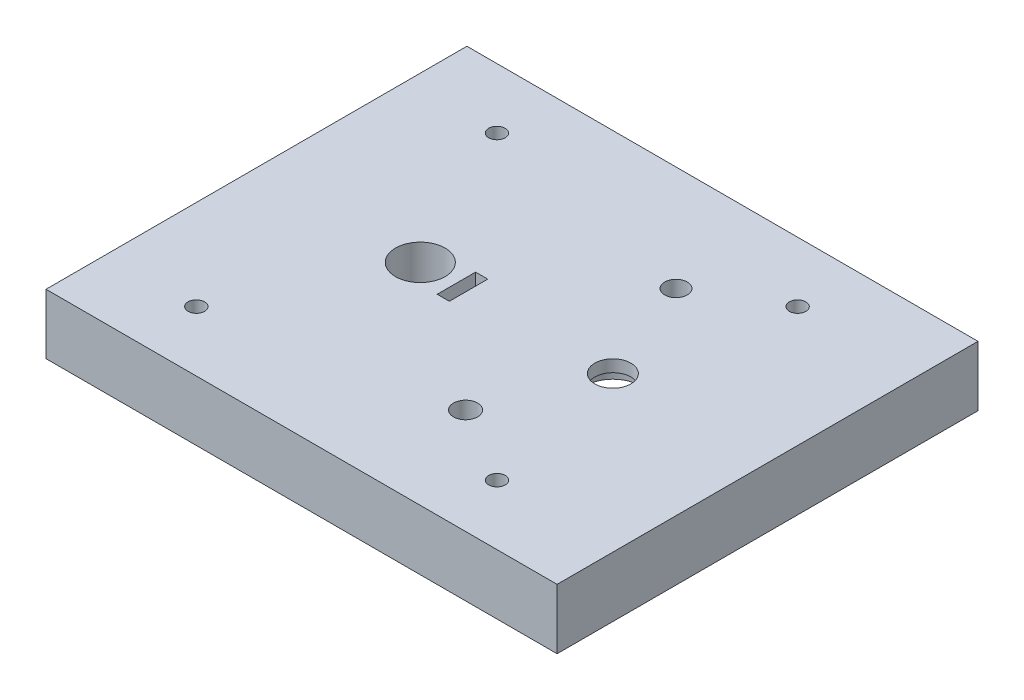
ISO-10303-21;
HEADER;
FILE_DESCRIPTION(('STEP AP214'),'2;1');
FILE_NAME('part.step','',(''),(''),'','','');
FILE_SCHEMA(('AUTOMOTIVE_DESIGN { 1 0 10303 214 1 1 1 1 }'));
ENDSEC;
DATA;
#1=APPLICATION_CONTEXT('core data for automotive mechanical design processes');
#2=APPLICATION_PROTOCOL_DEFINITION('international standard','automotive_design',2000,#1);
#3=PRODUCT_CONTEXT('',#1,'mechanical');
#4=PRODUCT('Part','Part','',(#3));
#5=PRODUCT_RELATED_PRODUCT_CATEGORY('part','',(#4));
#6=PRODUCT_DEFINITION_FORMATION('','',#4);
#7=PRODUCT_DEFINITION_CONTEXT('part definition',#1,'design');
#8=PRODUCT_DEFINITION('design','',#6,#7);
#9=PRODUCT_DEFINITION_SHAPE('','',#8);
#10=(LENGTH_UNIT() NAMED_UNIT(*) SI_UNIT(.MILLI.,.METRE.));
#11=(NAMED_UNIT(*) PLANE_ANGLE_UNIT() SI_UNIT($,.RADIAN.));
#12=(NAMED_UNIT(*) SI_UNIT($,.STERADIAN.) SOLID_ANGLE_UNIT());
#13=UNCERTAINTY_MEASURE_WITH_UNIT(LENGTH_MEASURE(1.E-05),#10,'distance_accuracy_value','');
#14=(GEOMETRIC_REPRESENTATION_CONTEXT(3) GLOBAL_UNCERTAINTY_ASSIGNED_CONTEXT((#13)) GLOBAL_UNIT_ASSIGNED_CONTEXT((#10,
#11,#12)) REPRESENTATION_CONTEXT('',''));
#15=CARTESIAN_POINT('',(0.,0.,0.));
#16=DIRECTION('',(0.,0.,1.));
#17=DIRECTION('',(1.,0.,0.));
#18=AXIS2_PLACEMENT_3D('',#15,#16,#17);
#19=CARTESIAN_POINT('',(0.,0.,0.));
#20=DIRECTION('',(0.,1.,0.));
#21=DIRECTION('',(0.,0.,1.));
#22=AXIS2_PLACEMENT_3D('',#19,#20,#21);
#23=PLANE('',#22);
#24=CARTESIAN_POINT('',(-37.2759249064414,0.,25.));
#25=DIRECTION('',(0.,1.,0.));
#26=DIRECTION('',(0.,0.,1.));
#27=AXIS2_PLACEMENT_3D('',#24,#25,#26);
#28=CIRCLE('',#27,1.375);
#29=CARTESIAN_POINT('',(-37.2759249064414,0.,26.375));
#30=VERTEX_POINT('',#29);
#31=EDGE_CURVE('E205',#30,#30,#28,.F.);
#32=ORIENTED_EDGE('',*,*,#31,.F.);
#33=EDGE_LOOP('',(#32));
#34=FACE_BOUND('',#33,.T.);
#35=DIRECTION('',(0.,0.,1.));
#36=VECTOR('',#35,1.);
#37=CARTESIAN_POINT('',(32.7240750935587,0.,0.));
#38=LINE('',#37,#36);
#39=CARTESIAN_POINT('',(32.7240750935586,0.,-35.));
#40=VERTEX_POINT('',#39);
#41=CARTESIAN_POINT('',(32.7240750935587,0.,35.));
#42=VERTEX_POINT('',#41);
#43=EDGE_CURVE('E195',#40,#42,#38,.T.);
#44=ORIENTED_EDGE('',*,*,#43,.T.);
#45=DIRECTION('',(1.,0.,0.));
#46=VECTOR('',#45,1.);
#47=CARTESIAN_POINT('',(0.,0.,35.));
#48=LINE('',#47,#46);
#49=CARTESIAN_POINT('',(-52.2759249064413,0.,35.));
#50=VERTEX_POINT('',#49);
#51=EDGE_CURVE('E87',#50,#42,#48,.T.);
#52=ORIENTED_EDGE('',*,*,#51,.F.);
#53=DIRECTION('',(0.,0.,1.));
#54=VECTOR('',#53,1.);
#55=CARTESIAN_POINT('',(-52.2759249064413,0.,0.));
#56=LINE('',#55,#54);
#57=CARTESIAN_POINT('',(-52.2759249064414,0.,-35.));
#58=VERTEX_POINT('',#57);
#59=EDGE_CURVE('E200',#58,#50,#56,.T.);
#60=ORIENTED_EDGE('',*,*,#59,.F.);
#61=DIRECTION('',(1.,0.,0.));
#62=VECTOR('',#61,1.);
#63=CARTESIAN_POINT('',(0.,0.,-35.));
#64=LINE('',#63,#62);
#65=EDGE_CURVE('E126',#58,#40,#64,.T.);
#66=ORIENTED_EDGE('',*,*,#65,.T.);
#67=EDGE_LOOP('',(#44,#52,#60,#66));
#68=FACE_BOUND('',#67,.T.);
#69=CARTESIAN_POINT('',(-37.2759249064414,0.,-25.));
#70=DIRECTION('',(0.,1.,0.));
#71=DIRECTION('',(0.,0.,1.));
#72=AXIS2_PLACEMENT_3D('',#69,#70,#71);
#73=CIRCLE('',#72,1.375);
#74=CARTESIAN_POINT('',(-37.2759249064414,0.,-23.625));
#75=VERTEX_POINT('',#74);
#76=EDGE_CURVE('E191',#75,#75,#73,.T.);
#77=ORIENTED_EDGE('',*,*,#76,.T.);
#78=EDGE_LOOP('',(#77));
#79=FACE_BOUND('',#78,.T.);
#80=CARTESIAN_POINT('',(12.7240750935586,0.,-25.));
#81=DIRECTION('',(0.,1.,0.));
#82=DIRECTION('',(0.,0.,1.));
#83=AXIS2_PLACEMENT_3D('',#80,#81,#82);
#84=CIRCLE('',#83,1.375);
#85=CARTESIAN_POINT('',(12.7240750935586,0.,-23.625));
#86=VERTEX_POINT('',#85);
#87=EDGE_CURVE('E187',#86,#86,#84,.T.);
#88=ORIENTED_EDGE('',*,*,#87,.T.);
#89=EDGE_LOOP('',(#88));
#90=FACE_BOUND('',#89,.T.);
#91=CARTESIAN_POINT('',(12.7240750935586,0.,25.));
#92=DIRECTION('',(0.,1.,0.));
#93=DIRECTION('',(0.,0.,1.));
#94=AXIS2_PLACEMENT_3D('',#91,#92,#93);
#95=CIRCLE('',#94,1.375);
#96=CARTESIAN_POINT('',(12.7240750935586,0.,26.375));
#97=VERTEX_POINT('',#96);
#98=EDGE_CURVE('E183',#97,#97,#95,.F.);
#99=ORIENTED_EDGE('',*,*,#98,.F.);
#100=EDGE_LOOP('',(#99));
#101=FACE_BOUND('',#100,.T.);
#102=CARTESIAN_POINT('',(-25.0246823688517,0.,0.));
#103=DIRECTION('',(0.,1.,0.));
#104=DIRECTION('',(0.,0.,1.));
#105=AXIS2_PLACEMENT_3D('',#102,#103,#104);
#106=CIRCLE('',#105,4.12500000000001);
#107=CARTESIAN_POINT('',(-25.0246823688517,0.,4.12500000000001));
#108=VERTEX_POINT('',#107);
#109=EDGE_CURVE('E179',#108,#108,#106,.T.);
#110=ORIENTED_EDGE('',*,*,#109,.T.);
#111=EDGE_LOOP('',(#110));
#112=FACE_BOUND('',#111,.T.);
#113=DIRECTION('',(1.,0.,0.));
#114=VECTOR('',#113,1.);
#115=CARTESIAN_POINT('',(0.,0.,3.19298794369084));
#116=LINE('',#115,#114);
#117=CARTESIAN_POINT('',(-19.0246823688517,0.,3.19298794369084));
#118=VERTEX_POINT('',#117);
#119=CARTESIAN_POINT('',(-17.,0.,3.19298794369084));
#120=VERTEX_POINT('',#119);
#121=EDGE_CURVE('E166',#118,#120,#116,.T.);
#122=ORIENTED_EDGE('',*,*,#121,.T.);
#123=DIRECTION('',(0.,0.,-1.));
#124=VECTOR('',#123,1.);
#125=CARTESIAN_POINT('',(-17.,0.,0.));
#126=LINE('',#125,#124);
#127=CARTESIAN_POINT('',(-17.,0.,7.));
#128=VERTEX_POINT('',#127);
#129=EDGE_CURVE('E510',#128,#120,#126,.T.);
#130=ORIENTED_EDGE('',*,*,#129,.F.);
#131=DIRECTION('',(1.,0.,0.));
#132=VECTOR('',#131,1.);
#133=CARTESIAN_POINT('',(0.,0.,7.));
#134=LINE('',#133,#132);
#135=CARTESIAN_POINT('',(-12.3547561691844,0.,7.));
#136=VERTEX_POINT('',#135);
#137=EDGE_CURVE('E516',#128,#136,#134,.T.);
#138=ORIENTED_EDGE('',*,*,#137,.T.);
#139=CARTESIAN_POINT('',(0.,0.,0.));
#140=DIRECTION('',(0.,1.,0.));
#141=DIRECTION('',(0.,0.,1.));
#142=AXIS2_PLACEMENT_3D('',#139,#140,#141);
#143=CIRCLE('',#142,14.2);
#144=CARTESIAN_POINT('',(-3.625,0.,13.7295074565696));
#145=VERTEX_POINT('',#144);
#146=EDGE_CURVE('E522',#136,#145,#143,.T.);
#147=ORIENTED_EDGE('',*,*,#146,.T.);
#148=DIRECTION('',(0.,0.,-1.));
#149=VECTOR('',#148,1.);
#150=CARTESIAN_POINT('',(-3.62500000000001,0.,0.));
#151=LINE('',#150,#149);
#152=CARTESIAN_POINT('',(-3.625,0.,17.5));
#153=VERTEX_POINT('',#152);
#154=EDGE_CURVE('E636',#153,#145,#151,.T.);
#155=ORIENTED_EDGE('',*,*,#154,.F.);
#156=CARTESIAN_POINT('',(0.,0.,17.5));
#157=DIRECTION('',(0.,1.,0.));
#158=DIRECTION('',(0.,0.,1.));
#159=AXIS2_PLACEMENT_3D('',#156,#157,#158);
#160=CIRCLE('',#159,3.625);
#161=CARTESIAN_POINT('',(3.625,0.,17.5));
#162=VERTEX_POINT('',#161);
#163=EDGE_CURVE('E640',#153,#162,#160,.T.);
#164=ORIENTED_EDGE('',*,*,#163,.T.);
#165=DIRECTION('',(0.,0.,-1.));
#166=VECTOR('',#165,1.);
#167=CARTESIAN_POINT('',(3.625,0.,0.));
#168=LINE('',#167,#166);
#169=CARTESIAN_POINT('',(3.625,0.,13.7295074565696));
#170=VERTEX_POINT('',#169);
#171=EDGE_CURVE('E645',#162,#170,#168,.T.);
#172=ORIENTED_EDGE('',*,*,#171,.T.);
#173=CARTESIAN_POINT('',(0.,0.,0.));
#174=DIRECTION('',(0.,1.,0.));
#175=DIRECTION('',(0.,0.,1.));
#176=AXIS2_PLACEMENT_3D('',#173,#174,#175);
#177=CIRCLE('',#176,14.2);
#178=CARTESIAN_POINT('',(3.62500000000001,0.,-13.7295074565696));
#179=VERTEX_POINT('',#178);
#180=EDGE_CURVE('E649',#170,#179,#177,.T.);
#181=ORIENTED_EDGE('',*,*,#180,.T.);
#182=DIRECTION('',(0.,0.,1.));
#183=VECTOR('',#182,1.);
#184=CARTESIAN_POINT('',(3.62500000000006,0.,0.));
#185=LINE('',#184,#183);
#186=CARTESIAN_POINT('',(3.62499999999999,0.,-17.5));
#187=VERTEX_POINT('',#186);
#188=EDGE_CURVE('E653',#187,#179,#185,.T.);
#189=ORIENTED_EDGE('',*,*,#188,.F.);
#190=CARTESIAN_POINT('',(0.,0.,-17.5));
#191=DIRECTION('',(0.,1.,0.));
#192=DIRECTION('',(0.,0.,1.));
#193=AXIS2_PLACEMENT_3D('',#190,#191,#192);
#194=CIRCLE('',#193,3.62499999999999);
#195=CARTESIAN_POINT('',(-3.625,0.,-17.5));
#196=VERTEX_POINT('',#195);
#197=EDGE_CURVE('E347',#187,#196,#194,.T.);
#198=ORIENTED_EDGE('',*,*,#197,.T.);
#199=DIRECTION('',(0.,0.,1.));
#200=VECTOR('',#199,1.);
#201=CARTESIAN_POINT('',(-3.62499999999998,0.,0.));
#202=LINE('',#201,#200);
#203=CARTESIAN_POINT('',(-3.62499999999999,0.,-13.7295074565696));
#204=VERTEX_POINT('',#203);
#205=EDGE_CURVE('E343',#196,#204,#202,.T.);
#206=ORIENTED_EDGE('',*,*,#205,.T.);
#207=CARTESIAN_POINT('',(0.,0.,0.));
#208=DIRECTION('',(0.,1.,0.));
#209=DIRECTION('',(0.,0.,1.));
#210=AXIS2_PLACEMENT_3D('',#207,#208,#209);
#211=CIRCLE('',#210,14.2);
#212=CARTESIAN_POINT('',(-12.3547561691844,0.,-7.));
#213=VERTEX_POINT('',#212);
#214=EDGE_CURVE('E321',#204,#213,#211,.T.);
#215=ORIENTED_EDGE('',*,*,#214,.T.);
#216=DIRECTION('',(1.,0.,0.));
#217=VECTOR('',#216,1.);
#218=CARTESIAN_POINT('',(0.,0.,-7.));
#219=LINE('',#218,#217);
#220=CARTESIAN_POINT('',(-17.,0.,-7.));
#221=VERTEX_POINT('',#220);
#222=EDGE_CURVE('E333',#221,#213,#219,.T.);
#223=ORIENTED_EDGE('',*,*,#222,.F.);
#224=CARTESIAN_POINT('',(-17.,0.,-3.19298794369084));
#225=VERTEX_POINT('',#224);
#226=EDGE_CURVE('E339',#225,#221,#126,.T.);
#227=ORIENTED_EDGE('',*,*,#226,.F.);
#228=DIRECTION('',(1.,0.,0.));
#229=VECTOR('',#228,1.);
#230=CARTESIAN_POINT('',(0.,0.,-3.19298794369084));
#231=LINE('',#230,#229);
#232=CARTESIAN_POINT('',(-19.0246823688517,0.,-3.19298794369084));
#233=VERTEX_POINT('',#232);
#234=EDGE_CURVE('E175',#233,#225,#231,.T.);
#235=ORIENTED_EDGE('',*,*,#234,.F.);
#236=DIRECTION('',(0.,0.,-1.));
#237=VECTOR('',#236,1.);
#238=CARTESIAN_POINT('',(-19.0246823688517,0.,0.));
#239=LINE('',#238,#237);
#240=EDGE_CURVE('E170',#118,#233,#239,.T.);
#241=ORIENTED_EDGE('',*,*,#240,.F.);
#242=EDGE_LOOP('',(#122,#130,#138,#147,#155,#164,#172,#181,#189,#198,#206,#215,#223,#227,#235,#241));
#243=FACE_BOUND('',#242,.T.);
#244=ADVANCED_FACE('F41',(#34,#68,#79,#90,#101,#112,#243),#23,.F.);
#245=CARTESIAN_POINT('',(32.7240750935587,10.,0.));
#246=DIRECTION('',(1.,0.,0.));
#247=DIRECTION('',(0.,0.,-1.));
#248=AXIS2_PLACEMENT_3D('',#245,#246,#247);
#249=PLANE('',#248);
#250=ORIENTED_EDGE('',*,*,#43,.F.);
#251=DIRECTION('',(0.,-1.,0.));
#252=VECTOR('',#251,1.);
#253=CARTESIAN_POINT('',(32.7240750935586,10.,-35.));
#254=LINE('',#253,#252);
#255=CARTESIAN_POINT('',(32.7240750935586,10.,-35.));
#256=VERTEX_POINT('',#255);
#257=EDGE_CURVE('E11',#256,#40,#254,.T.);
#258=ORIENTED_EDGE('',*,*,#257,.F.);
#259=DIRECTION('',(0.,0.,1.));
#260=VECTOR('',#259,1.);
#261=CARTESIAN_POINT('',(32.7240750935587,10.,0.));
#262=LINE('',#261,#260);
#263=CARTESIAN_POINT('',(32.7240750935587,10.,35.));
#264=VERTEX_POINT('',#263);
#265=EDGE_CURVE('E139',#256,#264,#262,.T.);
#266=ORIENTED_EDGE('',*,*,#265,.T.);
#267=DIRECTION('',(0.,-1.,0.));
#268=VECTOR('',#267,1.);
#269=CARTESIAN_POINT('',(32.7240750935587,10.,35.));
#270=LINE('',#269,#268);
#271=EDGE_CURVE('E94',#264,#42,#270,.T.);
#272=ORIENTED_EDGE('',*,*,#271,.T.);
#273=EDGE_LOOP('',(#250,#258,#266,#272));
#274=FACE_BOUND('',#273,.T.);
#275=ADVANCED_FACE('F437',(#274),#249,.T.);
#276=CARTESIAN_POINT('',(0.,10.,-35.));
#277=DIRECTION('',(0.,0.,-1.));
#278=DIRECTION('',(-1.,0.,0.));
#279=AXIS2_PLACEMENT_3D('',#276,#277,#278);
#280=PLANE('',#279);
#281=ORIENTED_EDGE('',*,*,#65,.F.);
#282=DIRECTION('',(0.,-1.,0.));
#283=VECTOR('',#282,1.);
#284=CARTESIAN_POINT('',(-52.2759249064414,10.,-35.));
#285=LINE('',#284,#283);
#286=CARTESIAN_POINT('',(-52.2759249064414,10.,-35.));
#287=VERTEX_POINT('',#286);
#288=EDGE_CURVE('E52',#287,#58,#285,.T.);
#289=ORIENTED_EDGE('',*,*,#288,.F.);
#290=DIRECTION('',(1.,0.,0.));
#291=VECTOR('',#290,1.);
#292=CARTESIAN_POINT('',(0.,10.,-35.));
#293=LINE('',#292,#291);
#294=EDGE_CURVE('E124',#287,#256,#293,.T.);
#295=ORIENTED_EDGE('',*,*,#294,.T.);
#296=ORIENTED_EDGE('',*,*,#257,.T.);
#297=EDGE_LOOP('',(#281,#289,#295,#296));
#298=FACE_BOUND('',#297,.T.);
#299=ADVANCED_FACE('F122',(#298),#280,.T.);
#300=CARTESIAN_POINT('',(-52.2759249064413,10.,0.));
#301=DIRECTION('',(1.,0.,0.));
#302=DIRECTION('',(0.,0.,-1.));
#303=AXIS2_PLACEMENT_3D('',#300,#301,#302);
#304=PLANE('',#303);
#305=ORIENTED_EDGE('',*,*,#59,.T.);
#306=DIRECTION('',(0.,-1.,0.));
#307=VECTOR('',#306,1.);
#308=CARTESIAN_POINT('',(-52.2759249064413,10.,35.));
#309=LINE('',#308,#307);
#310=CARTESIAN_POINT('',(-52.2759249064413,10.,35.));
#311=VERTEX_POINT('',#310);
#312=EDGE_CURVE('E130',#311,#50,#309,.T.);
#313=ORIENTED_EDGE('',*,*,#312,.F.);
#314=DIRECTION('',(0.,0.,1.));
#315=VECTOR('',#314,1.);
#316=CARTESIAN_POINT('',(-52.2759249064413,10.,0.));
#317=LINE('',#316,#315);
#318=EDGE_CURVE('E133',#287,#311,#317,.T.);
#319=ORIENTED_EDGE('',*,*,#318,.F.);
#320=ORIENTED_EDGE('',*,*,#288,.T.);
#321=EDGE_LOOP('',(#305,#313,#319,#320));
#322=FACE_BOUND('',#321,.T.);
#323=ADVANCED_FACE('F134',(#322),#304,.F.);
#324=CARTESIAN_POINT('',(-17.,10.,0.));
#325=DIRECTION('',(-1.,0.,0.));
#326=DIRECTION('',(0.,0.,1.));
#327=AXIS2_PLACEMENT_3D('',#324,#325,#326);
#328=PLANE('',#327);
#329=DIRECTION('',(0.,0.,-1.));
#330=VECTOR('',#329,1.);
#331=CARTESIAN_POINT('',(-17.,6.,0.));
#332=LINE('',#331,#330);
#333=CARTESIAN_POINT('',(-17.,6.,3.19298794369084));
#334=VERTEX_POINT('',#333);
#335=CARTESIAN_POINT('',(-17.,6.,-3.19298794369084));
#336=VERTEX_POINT('',#335);
#337=EDGE_CURVE('E171',#334,#336,#332,.T.);
#338=ORIENTED_EDGE('',*,*,#337,.F.);
#339=DIRECTION('',(0.,-1.,0.));
#340=VECTOR('',#339,1.);
#341=CARTESIAN_POINT('',(-17.,10.,3.19298794369084));
#342=LINE('',#341,#340);
#343=CARTESIAN_POINT('',(-17.,10.,3.19298794369084));
#344=VERTEX_POINT('',#343);
#345=EDGE_CURVE('E45',#344,#334,#342,.T.);
#346=ORIENTED_EDGE('',*,*,#345,.F.);
#347=DIRECTION('',(0.,0.,-1.));
#348=VECTOR('',#347,1.);
#349=CARTESIAN_POINT('',(-17.,10.,0.));
#350=LINE('',#349,#348);
#351=CARTESIAN_POINT('',(-17.,10.,-3.19298794369084));
#352=VERTEX_POINT('',#351);
#353=EDGE_CURVE('E209',#344,#352,#350,.T.);
#354=ORIENTED_EDGE('',*,*,#353,.T.);
#355=DIRECTION('',(0.,-1.,0.));
#356=VECTOR('',#355,1.);
#357=CARTESIAN_POINT('',(-17.,10.,-3.19298794369084));
#358=LINE('',#357,#356);
#359=EDGE_CURVE('E165',#352,#336,#358,.T.);
#360=ORIENTED_EDGE('',*,*,#359,.T.);
#361=EDGE_LOOP('',(#338,#346,#354,#360));
#362=FACE_BOUND('',#361,.T.);
#363=ADVANCED_FACE('F43',(#362),#328,.T.);
#364=CARTESIAN_POINT('',(0.,10.,3.19298794369084));
#365=DIRECTION('',(0.,0.,-1.));
#366=DIRECTION('',(-1.,0.,0.));
#367=AXIS2_PLACEMENT_3D('',#364,#365,#366);
#368=PLANE('',#367);
#369=ORIENTED_EDGE('',*,*,#345,.T.);
#370=DIRECTION('',(0.,-1.,0.));
#371=VECTOR('',#370,1.);
#372=CARTESIAN_POINT('',(-17.,6.,3.19298794369084));
#373=LINE('',#372,#371);
#374=EDGE_CURVE('E233',#334,#120,#373,.T.);
#375=ORIENTED_EDGE('',*,*,#374,.T.);
#376=ORIENTED_EDGE('',*,*,#121,.F.);
#377=DIRECTION('',(0.,-1.,0.));
#378=VECTOR('',#377,1.);
#379=CARTESIAN_POINT('',(-19.0246823688517,10.,3.19298794369084));
#380=LINE('',#379,#378);
#381=CARTESIAN_POINT('',(-19.0246823688517,10.,3.19298794369084));
#382=VERTEX_POINT('',#381);
#383=EDGE_CURVE('E219',#382,#118,#380,.T.);
#384=ORIENTED_EDGE('',*,*,#383,.F.);
#385=DIRECTION('',(1.,0.,0.));
#386=VECTOR('',#385,1.);
#387=CARTESIAN_POINT('',(0.,10.,3.19298794369084));
#388=LINE('',#387,#386);
#389=EDGE_CURVE('E235',#382,#344,#388,.T.);
#390=ORIENTED_EDGE('',*,*,#389,.T.);
#391=EDGE_LOOP('',(#369,#375,#376,#384,#390));
#392=FACE_BOUND('',#391,.T.);
#393=ADVANCED_FACE('F229',(#392),#368,.T.);
#394=CARTESIAN_POINT('',(-19.0246823688517,10.,0.));
#395=DIRECTION('',(-1.,0.,0.));
#396=DIRECTION('',(0.,0.,1.));
#397=AXIS2_PLACEMENT_3D('',#394,#395,#396);
#398=PLANE('',#397);
#399=ORIENTED_EDGE('',*,*,#383,.T.);
#400=ORIENTED_EDGE('',*,*,#240,.T.);
#401=DIRECTION('',(0.,-1.,0.));
#402=VECTOR('',#401,1.);
#403=CARTESIAN_POINT('',(-19.0246823688517,10.,-3.19298794369084));
#404=LINE('',#403,#402);
#405=CARTESIAN_POINT('',(-19.0246823688517,10.,-3.19298794369084));
#406=VERTEX_POINT('',#405);
#407=EDGE_CURVE('E217',#406,#233,#404,.T.);
#408=ORIENTED_EDGE('',*,*,#407,.F.);
#409=DIRECTION('',(0.,0.,-1.));
#410=VECTOR('',#409,1.);
#411=CARTESIAN_POINT('',(-19.0246823688517,10.,0.));
#412=LINE('',#411,#410);
#413=EDGE_CURVE('E394',#382,#406,#412,.T.);
#414=ORIENTED_EDGE('',*,*,#413,.F.);
#415=EDGE_LOOP('',(#399,#400,#408,#414));
#416=FACE_BOUND('',#415,.T.);
#417=ADVANCED_FACE('F449',(#416),#398,.F.);
#418=CARTESIAN_POINT('',(0.,10.,17.5));
#419=DIRECTION('',(0.,-1.,0.));
#420=DIRECTION('',(0.,0.,-1.));
#421=AXIS2_PLACEMENT_3D('',#418,#419,#420);
#422=CYLINDRICAL_SURFACE('',#421,2.);
#423=CARTESIAN_POINT('',(0.,6.,17.5));
#424=DIRECTION('',(0.,1.,0.));
#425=DIRECTION('',(0.,0.,1.));
#426=AXIS2_PLACEMENT_3D('',#423,#424,#425);
#427=CIRCLE('',#426,2.);
#428=CARTESIAN_POINT('',(0.,6.,19.5));
#429=VERTEX_POINT('',#428);
#430=EDGE_CURVE('E354',#429,#429,#427,.T.);
#431=ORIENTED_EDGE('',*,*,#430,.F.);
#432=EDGE_LOOP('',(#431));
#433=FACE_BOUND('',#432,.T.);
#434=CARTESIAN_POINT('',(0.,10.,17.5));
#435=DIRECTION('',(0.,1.,0.));
#436=DIRECTION('',(0.,0.,1.));
#437=AXIS2_PLACEMENT_3D('',#434,#435,#436);
#438=CIRCLE('',#437,2.);
#439=CARTESIAN_POINT('',(0.,10.,19.5));
#440=VERTEX_POINT('',#439);
#441=EDGE_CURVE('E157',#440,#440,#438,.T.);
#442=ORIENTED_EDGE('',*,*,#441,.T.);
#443=EDGE_LOOP('',(#442));
#444=FACE_BOUND('',#443,.T.);
#445=ADVANCED_FACE('F445',(#433,#444),#422,.F.);
#446=CARTESIAN_POINT('',(0.,10.,-17.5));
#447=DIRECTION('',(0.,-1.,0.));
#448=DIRECTION('',(0.,0.,-1.));
#449=AXIS2_PLACEMENT_3D('',#446,#447,#448);
#450=CYLINDRICAL_SURFACE('',#449,1.875);
#451=CARTESIAN_POINT('',(0.,6.,-17.5));
#452=DIRECTION('',(0.,1.,0.));
#453=DIRECTION('',(0.,0.,1.));
#454=AXIS2_PLACEMENT_3D('',#451,#452,#453);
#455=CIRCLE('',#454,1.875);
#456=CARTESIAN_POINT('',(0.,6.,-15.625));
#457=VERTEX_POINT('',#456);
#458=EDGE_CURVE('E502',#457,#457,#455,.T.);
#459=ORIENTED_EDGE('',*,*,#458,.F.);
#460=EDGE_LOOP('',(#459));
#461=FACE_BOUND('',#460,.T.);
#462=CARTESIAN_POINT('',(0.,10.,-17.5));
#463=DIRECTION('',(0.,1.,0.));
#464=DIRECTION('',(0.,0.,1.));
#465=AXIS2_PLACEMENT_3D('',#462,#463,#464);
#466=CIRCLE('',#465,1.875);
#467=CARTESIAN_POINT('',(0.,10.,-15.625));
#468=VERTEX_POINT('',#467);
#469=EDGE_CURVE('E153',#468,#468,#466,.T.);
#470=ORIENTED_EDGE('',*,*,#469,.T.);
#471=EDGE_LOOP('',(#470));
#472=FACE_BOUND('',#471,.T.);
#473=ADVANCED_FACE('F448',(#461,#472),#450,.F.);
#474=CARTESIAN_POINT('',(-37.2759249064414,10.,25.));
#475=DIRECTION('',(0.,-1.,0.));
#476=DIRECTION('',(0.,0.,-1.));
#477=AXIS2_PLACEMENT_3D('',#474,#475,#476);
#478=CYLINDRICAL_SURFACE('',#477,1.375);
#479=CARTESIAN_POINT('',(-37.2759249064414,10.,25.));
#480=DIRECTION('',(0.,1.,0.));
#481=DIRECTION('',(0.,0.,1.));
#482=AXIS2_PLACEMENT_3D('',#479,#480,#481);
#483=CIRCLE('',#482,1.375);
#484=CARTESIAN_POINT('',(-37.2759249064414,10.,26.375));
#485=VERTEX_POINT('',#484);
#486=EDGE_CURVE('E149',#485,#485,#483,.F.);
#487=ORIENTED_EDGE('',*,*,#486,.F.);
#488=EDGE_LOOP('',(#487));
#489=FACE_BOUND('',#488,.T.);
#490=ORIENTED_EDGE('',*,*,#31,.T.);
#491=EDGE_LOOP('',(#490));
#492=FACE_BOUND('',#491,.T.);
#493=ADVANCED_FACE('F453',(#489,#492),#478,.F.);
#494=CARTESIAN_POINT('',(0.,10.,35.));
#495=DIRECTION('',(0.,0.,-1.));
#496=DIRECTION('',(-1.,0.,0.));
#497=AXIS2_PLACEMENT_3D('',#494,#495,#496);
#498=PLANE('',#497);
#499=ORIENTED_EDGE('',*,*,#51,.T.);
#500=ORIENTED_EDGE('',*,*,#271,.F.);
#501=DIRECTION('',(1.,0.,0.));
#502=VECTOR('',#501,1.);
#503=CARTESIAN_POINT('',(0.,10.,35.));
#504=LINE('',#503,#502);
#505=EDGE_CURVE('E61',#311,#264,#504,.T.);
#506=ORIENTED_EDGE('',*,*,#505,.F.);
#507=ORIENTED_EDGE('',*,*,#312,.T.);
#508=EDGE_LOOP('',(#499,#500,#506,#507));
#509=FACE_BOUND('',#508,.T.);
#510=ADVANCED_FACE('F457',(#509),#498,.F.);
#511=CARTESIAN_POINT('',(-37.2759249064414,10.,-25.));
#512=DIRECTION('',(0.,-1.,0.));
#513=DIRECTION('',(0.,0.,-1.));
#514=AXIS2_PLACEMENT_3D('',#511,#512,#513);
#515=CYLINDRICAL_SURFACE('',#514,1.375);
#516=CARTESIAN_POINT('',(-37.2759249064414,10.,-25.));
#517=DIRECTION('',(0.,1.,0.));
#518=DIRECTION('',(0.,0.,1.));
#519=AXIS2_PLACEMENT_3D('',#516,#517,#518);
#520=CIRCLE('',#519,1.375);
#521=CARTESIAN_POINT('',(-37.2759249064414,10.,-23.625));
#522=VERTEX_POINT('',#521);
#523=EDGE_CURVE('E143',#522,#522,#520,.T.);
#524=ORIENTED_EDGE('',*,*,#523,.T.);
#525=EDGE_LOOP('',(#524));
#526=FACE_BOUND('',#525,.T.);
#527=ORIENTED_EDGE('',*,*,#76,.F.);
#528=EDGE_LOOP('',(#527));
#529=FACE_BOUND('',#528,.T.);
#530=ADVANCED_FACE('F415',(#526,#529),#515,.F.);
#531=CARTESIAN_POINT('',(12.7240750935586,10.,-25.));
#532=DIRECTION('',(0.,-1.,0.));
#533=DIRECTION('',(0.,0.,-1.));
#534=AXIS2_PLACEMENT_3D('',#531,#532,#533);
#535=CYLINDRICAL_SURFACE('',#534,1.375);
#536=CARTESIAN_POINT('',(12.7240750935586,10.,-25.));
#537=DIRECTION('',(0.,1.,0.));
#538=DIRECTION('',(0.,0.,1.));
#539=AXIS2_PLACEMENT_3D('',#536,#537,#538);
#540=CIRCLE('',#539,1.375);
#541=CARTESIAN_POINT('',(12.7240750935586,10.,-23.625));
#542=VERTEX_POINT('',#541);
#543=EDGE_CURVE('E408',#542,#542,#540,.T.);
#544=ORIENTED_EDGE('',*,*,#543,.T.);
#545=EDGE_LOOP('',(#544));
#546=FACE_BOUND('',#545,.T.);
#547=ORIENTED_EDGE('',*,*,#87,.F.);
#548=EDGE_LOOP('',(#547));
#549=FACE_BOUND('',#548,.T.);
#550=ADVANCED_FACE('F468',(#546,#549),#535,.F.);
#551=CARTESIAN_POINT('',(12.7240750935586,10.,25.));
#552=DIRECTION('',(0.,-1.,0.));
#553=DIRECTION('',(0.,0.,-1.));
#554=AXIS2_PLACEMENT_3D('',#551,#552,#553);
#555=CYLINDRICAL_SURFACE('',#554,1.375);
#556=CARTESIAN_POINT('',(12.7240750935586,10.,25.));
#557=DIRECTION('',(0.,1.,0.));
#558=DIRECTION('',(0.,0.,1.));
#559=AXIS2_PLACEMENT_3D('',#556,#557,#558);
#560=CIRCLE('',#559,1.375);
#561=CARTESIAN_POINT('',(12.7240750935586,10.,26.375));
#562=VERTEX_POINT('',#561);
#563=EDGE_CURVE('E404',#562,#562,#560,.F.);
#564=ORIENTED_EDGE('',*,*,#563,.F.);
#565=EDGE_LOOP('',(#564));
#566=FACE_BOUND('',#565,.T.);
#567=ORIENTED_EDGE('',*,*,#98,.T.);
#568=EDGE_LOOP('',(#567));
#569=FACE_BOUND('',#568,.T.);
#570=ADVANCED_FACE('F471',(#566,#569),#555,.F.);
#571=CARTESIAN_POINT('',(-25.0246823688517,10.,0.));
#572=DIRECTION('',(0.,-1.,0.));
#573=DIRECTION('',(0.,0.,-1.));
#574=AXIS2_PLACEMENT_3D('',#571,#572,#573);
#575=CYLINDRICAL_SURFACE('',#574,4.12500000000001);
#576=CARTESIAN_POINT('',(-25.0246823688517,10.,0.));
#577=DIRECTION('',(0.,1.,0.));
#578=DIRECTION('',(0.,0.,1.));
#579=AXIS2_PLACEMENT_3D('',#576,#577,#578);
#580=CIRCLE('',#579,4.12500000000001);
#581=CARTESIAN_POINT('',(-25.0246823688517,10.,4.12500000000001));
#582=VERTEX_POINT('',#581);
#583=EDGE_CURVE('E400',#582,#582,#580,.T.);
#584=ORIENTED_EDGE('',*,*,#583,.T.);
#585=EDGE_LOOP('',(#584));
#586=FACE_BOUND('',#585,.T.);
#587=ORIENTED_EDGE('',*,*,#109,.F.);
#588=EDGE_LOOP('',(#587));
#589=FACE_BOUND('',#588,.T.);
#590=ADVANCED_FACE('F475',(#586,#589),#575,.F.);
#591=CARTESIAN_POINT('',(0.,10.,-3.19298794369084));
#592=DIRECTION('',(0.,0.,-1.));
#593=DIRECTION('',(-1.,0.,0.));
#594=AXIS2_PLACEMENT_3D('',#591,#592,#593);
#595=PLANE('',#594);
#596=ORIENTED_EDGE('',*,*,#407,.T.);
#597=ORIENTED_EDGE('',*,*,#234,.T.);
#598=DIRECTION('',(0.,-1.,0.));
#599=VECTOR('',#598,1.);
#600=CARTESIAN_POINT('',(-17.,6.,-3.19298794369084));
#601=LINE('',#600,#599);
#602=EDGE_CURVE('E351',#336,#225,#601,.T.);
#603=ORIENTED_EDGE('',*,*,#602,.F.);
#604=ORIENTED_EDGE('',*,*,#359,.F.);
#605=DIRECTION('',(1.,0.,0.));
#606=VECTOR('',#605,1.);
#607=CARTESIAN_POINT('',(0.,10.,-3.19298794369084));
#608=LINE('',#607,#606);
#609=EDGE_CURVE('E397',#406,#352,#608,.T.);
#610=ORIENTED_EDGE('',*,*,#609,.F.);
#611=EDGE_LOOP('',(#596,#597,#603,#604,#610));
#612=FACE_BOUND('',#611,.T.);
#613=ADVANCED_FACE('F430',(#612),#595,.F.);
#614=CARTESIAN_POINT('',(7.,10.,0.));
#615=DIRECTION('',(0.,-1.,0.));
#616=DIRECTION('',(0.,0.,-1.));
#617=AXIS2_PLACEMENT_3D('',#614,#615,#616);
#618=CYLINDRICAL_SURFACE('',#617,2.99999999999999);
#619=CARTESIAN_POINT('',(7.,8.,0.));
#620=DIRECTION('',(0.,1.,0.));
#621=DIRECTION('',(0.,0.,1.));
#622=AXIS2_PLACEMENT_3D('',#619,#620,#621);
#623=CIRCLE('',#622,2.99999999999999);
#624=CARTESIAN_POINT('',(7.,8.,2.99999999999999));
#625=VERTEX_POINT('',#624);
#626=EDGE_CURVE('E530',#625,#625,#623,.T.);
#627=ORIENTED_EDGE('',*,*,#626,.F.);
#628=EDGE_LOOP('',(#627));
#629=FACE_BOUND('',#628,.T.);
#630=CARTESIAN_POINT('',(7.,10.,0.));
#631=DIRECTION('',(0.,1.,0.));
#632=DIRECTION('',(0.,0.,1.));
#633=AXIS2_PLACEMENT_3D('',#630,#631,#632);
#634=CIRCLE('',#633,2.99999999999999);
#635=CARTESIAN_POINT('',(7.,10.,2.99999999999999));
#636=VERTEX_POINT('',#635);
#637=EDGE_CURVE('E161',#636,#636,#634,.T.);
#638=ORIENTED_EDGE('',*,*,#637,.T.);
#639=EDGE_LOOP('',(#638));
#640=FACE_BOUND('',#639,.T.);
#641=ADVANCED_FACE('F420',(#629,#640),#618,.F.);
#642=CARTESIAN_POINT('',(0.,10.,0.));
#643=DIRECTION('',(0.,1.,0.));
#644=DIRECTION('',(0.,0.,1.));
#645=AXIS2_PLACEMENT_3D('',#642,#643,#644);
#646=PLANE('',#645);
#647=ORIENTED_EDGE('',*,*,#353,.F.);
#648=ORIENTED_EDGE('',*,*,#389,.F.);
#649=ORIENTED_EDGE('',*,*,#413,.T.);
#650=ORIENTED_EDGE('',*,*,#609,.T.);
#651=EDGE_LOOP('',(#647,#648,#649,#650));
#652=FACE_BOUND('',#651,.T.);
#653=ORIENTED_EDGE('',*,*,#583,.F.);
#654=EDGE_LOOP('',(#653));
#655=FACE_BOUND('',#654,.T.);
#656=ORIENTED_EDGE('',*,*,#563,.T.);
#657=EDGE_LOOP('',(#656));
#658=FACE_BOUND('',#657,.T.);
#659=ORIENTED_EDGE('',*,*,#543,.F.);
#660=EDGE_LOOP('',(#659));
#661=FACE_BOUND('',#660,.T.);
#662=ORIENTED_EDGE('',*,*,#523,.F.);
#663=EDGE_LOOP('',(#662));
#664=FACE_BOUND('',#663,.T.);
#665=ORIENTED_EDGE('',*,*,#265,.F.);
#666=ORIENTED_EDGE('',*,*,#294,.F.);
#667=ORIENTED_EDGE('',*,*,#318,.T.);
#668=ORIENTED_EDGE('',*,*,#505,.T.);
#669=EDGE_LOOP('',(#665,#666,#667,#668));
#670=FACE_BOUND('',#669,.T.);
#671=ORIENTED_EDGE('',*,*,#486,.T.);
#672=EDGE_LOOP('',(#671));
#673=FACE_BOUND('',#672,.T.);
#674=ORIENTED_EDGE('',*,*,#469,.F.);
#675=EDGE_LOOP('',(#674));
#676=FACE_BOUND('',#675,.T.);
#677=ORIENTED_EDGE('',*,*,#441,.F.);
#678=EDGE_LOOP('',(#677));
#679=FACE_BOUND('',#678,.T.);
#680=ORIENTED_EDGE('',*,*,#637,.F.);
#681=EDGE_LOOP('',(#680));
#682=FACE_BOUND('',#681,.T.);
#683=ADVANCED_FACE('F137',(#652,#655,#658,#661,#664,#670,#673,#676,#679,#682),#646,.T.);
#684=CARTESIAN_POINT('',(-17.,6.,0.));
#685=DIRECTION('',(-1.,0.,0.));
#686=DIRECTION('',(0.,0.,1.));
#687=AXIS2_PLACEMENT_3D('',#684,#685,#686);
#688=PLANE('',#687);
#689=ORIENTED_EDGE('',*,*,#129,.T.);
#690=ORIENTED_EDGE('',*,*,#374,.F.);
#691=DIRECTION('',(0.,0.,-1.));
#692=VECTOR('',#691,1.);
#693=CARTESIAN_POINT('',(-17.,6.,0.));
#694=LINE('',#693,#692);
#695=CARTESIAN_POINT('',(-17.,6.,7.));
#696=VERTEX_POINT('',#695);
#697=EDGE_CURVE('E498',#696,#334,#694,.T.);
#698=ORIENTED_EDGE('',*,*,#697,.F.);
#699=DIRECTION('',(0.,-1.,0.));
#700=VECTOR('',#699,1.);
#701=CARTESIAN_POINT('',(-17.,6.,7.));
#702=LINE('',#701,#700);
#703=EDGE_CURVE('E383',#696,#128,#702,.T.);
#704=ORIENTED_EDGE('',*,*,#703,.T.);
#705=EDGE_LOOP('',(#689,#690,#698,#704));
#706=FACE_BOUND('',#705,.T.);
#707=ADVANCED_FACE('F419',(#706),#688,.F.);
#708=CARTESIAN_POINT('',(0.,6.,7.));
#709=DIRECTION('',(0.,0.,-1.));
#710=DIRECTION('',(-1.,0.,0.));
#711=AXIS2_PLACEMENT_3D('',#708,#709,#710);
#712=PLANE('',#711);
#713=ORIENTED_EDGE('',*,*,#137,.F.);
#714=ORIENTED_EDGE('',*,*,#703,.F.);
#715=DIRECTION('',(1.,0.,0.));
#716=VECTOR('',#715,1.);
#717=CARTESIAN_POINT('',(0.,6.,7.));
#718=LINE('',#717,#716);
#719=CARTESIAN_POINT('',(-12.3547561691844,6.,7.));
#720=VERTEX_POINT('',#719);
#721=EDGE_CURVE('E512',#696,#720,#718,.T.);
#722=ORIENTED_EDGE('',*,*,#721,.T.);
#723=DIRECTION('',(0.,-1.,0.));
#724=VECTOR('',#723,1.);
#725=CARTESIAN_POINT('',(-12.3547561691844,6.,7.));
#726=LINE('',#725,#724);
#727=EDGE_CURVE('E380',#720,#136,#726,.T.);
#728=ORIENTED_EDGE('',*,*,#727,.T.);
#729=EDGE_LOOP('',(#713,#714,#722,#728));
#730=FACE_BOUND('',#729,.T.);
#731=ADVANCED_FACE('F427',(#730),#712,.T.);
#732=CARTESIAN_POINT('',(0.,6.,0.));
#733=DIRECTION('',(0.,-1.,0.));
#734=DIRECTION('',(0.,0.,-1.));
#735=AXIS2_PLACEMENT_3D('',#732,#733,#734);
#736=CYLINDRICAL_SURFACE('',#735,14.2);
#737=ORIENTED_EDGE('',*,*,#146,.F.);
#738=ORIENTED_EDGE('',*,*,#727,.F.);
#739=CARTESIAN_POINT('',(0.,6.,0.));
#740=DIRECTION('',(0.,1.,0.));
#741=DIRECTION('',(0.,0.,1.));
#742=AXIS2_PLACEMENT_3D('',#739,#740,#741);
#743=CIRCLE('',#742,14.2);
#744=CARTESIAN_POINT('',(-3.625,6.,13.7295074565696));
#745=VERTEX_POINT('',#744);
#746=EDGE_CURVE('E536',#720,#745,#743,.T.);
#747=ORIENTED_EDGE('',*,*,#746,.T.);
#748=DIRECTION('',(0.,-1.,0.));
#749=VECTOR('',#748,1.);
#750=CARTESIAN_POINT('',(-3.625,6.,13.7295074565696));
#751=LINE('',#750,#749);
#752=EDGE_CURVE('E377',#745,#145,#751,.T.);
#753=ORIENTED_EDGE('',*,*,#752,.T.);
#754=EDGE_LOOP('',(#737,#738,#747,#753));
#755=FACE_BOUND('',#754,.T.);
#756=ADVANCED_FACE('F621',(#755),#736,.F.);
#757=CARTESIAN_POINT('',(-3.62500000000001,6.,0.));
#758=DIRECTION('',(-1.,0.,0.));
#759=DIRECTION('',(0.,0.,1.));
#760=AXIS2_PLACEMENT_3D('',#757,#758,#759);
#761=PLANE('',#760);
#762=ORIENTED_EDGE('',*,*,#154,.T.);
#763=ORIENTED_EDGE('',*,*,#752,.F.);
#764=DIRECTION('',(0.,0.,-1.));
#765=VECTOR('',#764,1.);
#766=CARTESIAN_POINT('',(-3.62500000000001,6.,0.));
#767=LINE('',#766,#765);
#768=CARTESIAN_POINT('',(-3.625,6.,17.5));
#769=VERTEX_POINT('',#768);
#770=EDGE_CURVE('E539',#769,#745,#767,.T.);
#771=ORIENTED_EDGE('',*,*,#770,.F.);
#772=DIRECTION('',(0.,-1.,0.));
#773=VECTOR('',#772,1.);
#774=CARTESIAN_POINT('',(-3.625,6.,17.5));
#775=LINE('',#774,#773);
#776=EDGE_CURVE('E374',#769,#153,#775,.T.);
#777=ORIENTED_EDGE('',*,*,#776,.T.);
#778=EDGE_LOOP('',(#762,#763,#771,#777));
#779=FACE_BOUND('',#778,.T.);
#780=ADVANCED_FACE('F617',(#779),#761,.F.);
#781=CARTESIAN_POINT('',(0.,6.,17.5));
#782=DIRECTION('',(0.,-1.,0.));
#783=DIRECTION('',(0.,0.,-1.));
#784=AXIS2_PLACEMENT_3D('',#781,#782,#783);
#785=CYLINDRICAL_SURFACE('',#784,3.625);
#786=ORIENTED_EDGE('',*,*,#163,.F.);
#787=ORIENTED_EDGE('',*,*,#776,.F.);
#788=CARTESIAN_POINT('',(0.,6.,17.5));
#789=DIRECTION('',(0.,1.,0.));
#790=DIRECTION('',(0.,0.,1.));
#791=AXIS2_PLACEMENT_3D('',#788,#789,#790);
#792=CIRCLE('',#791,3.625);
#793=CARTESIAN_POINT('',(3.625,6.,17.5));
#794=VERTEX_POINT('',#793);
#795=EDGE_CURVE('E543',#769,#794,#792,.T.);
#796=ORIENTED_EDGE('',*,*,#795,.T.);
#797=DIRECTION('',(0.,-1.,0.));
#798=VECTOR('',#797,1.);
#799=CARTESIAN_POINT('',(3.625,6.,17.5));
#800=LINE('',#799,#798);
#801=EDGE_CURVE('E371',#794,#162,#800,.T.);
#802=ORIENTED_EDGE('',*,*,#801,.T.);
#803=EDGE_LOOP('',(#786,#787,#796,#802));
#804=FACE_BOUND('',#803,.T.);
#805=ADVANCED_FACE('F613',(#804),#785,.F.);
#806=CARTESIAN_POINT('',(3.625,6.,0.));
#807=DIRECTION('',(-1.,0.,0.));
#808=DIRECTION('',(0.,0.,1.));
#809=AXIS2_PLACEMENT_3D('',#806,#807,#808);
#810=PLANE('',#809);
#811=ORIENTED_EDGE('',*,*,#171,.F.);
#812=ORIENTED_EDGE('',*,*,#801,.F.);
#813=DIRECTION('',(0.,0.,-1.));
#814=VECTOR('',#813,1.);
#815=CARTESIAN_POINT('',(3.625,6.,0.));
#816=LINE('',#815,#814);
#817=CARTESIAN_POINT('',(3.625,6.,13.7295074565696));
#818=VERTEX_POINT('',#817);
#819=EDGE_CURVE('E546',#794,#818,#816,.T.);
#820=ORIENTED_EDGE('',*,*,#819,.T.);
#821=DIRECTION('',(0.,-1.,0.));
#822=VECTOR('',#821,1.);
#823=CARTESIAN_POINT('',(3.625,6.,13.7295074565696));
#824=LINE('',#823,#822);
#825=EDGE_CURVE('E368',#818,#170,#824,.T.);
#826=ORIENTED_EDGE('',*,*,#825,.T.);
#827=EDGE_LOOP('',(#811,#812,#820,#826));
#828=FACE_BOUND('',#827,.T.);
#829=ADVANCED_FACE('F609',(#828),#810,.T.);
#830=CARTESIAN_POINT('',(0.,6.,0.));
#831=DIRECTION('',(0.,-1.,0.));
#832=DIRECTION('',(0.,0.,-1.));
#833=AXIS2_PLACEMENT_3D('',#830,#831,#832);
#834=CYLINDRICAL_SURFACE('',#833,14.2);
#835=ORIENTED_EDGE('',*,*,#180,.F.);
#836=ORIENTED_EDGE('',*,*,#825,.F.);
#837=CARTESIAN_POINT('',(0.,6.,0.));
#838=DIRECTION('',(0.,1.,0.));
#839=DIRECTION('',(0.,0.,1.));
#840=AXIS2_PLACEMENT_3D('',#837,#838,#839);
#841=CIRCLE('',#840,14.2);
#842=CARTESIAN_POINT('',(3.62500000000001,6.,-13.7295074565696));
#843=VERTEX_POINT('',#842);
#844=EDGE_CURVE('E549',#818,#843,#841,.T.);
#845=ORIENTED_EDGE('',*,*,#844,.T.);
#846=DIRECTION('',(0.,-1.,0.));
#847=VECTOR('',#846,1.);
#848=CARTESIAN_POINT('',(3.62500000000001,6.,-13.7295074565696));
#849=LINE('',#848,#847);
#850=EDGE_CURVE('E365',#843,#179,#849,.T.);
#851=ORIENTED_EDGE('',*,*,#850,.T.);
#852=EDGE_LOOP('',(#835,#836,#845,#851));
#853=FACE_BOUND('',#852,.T.);
#854=ADVANCED_FACE('F605',(#853),#834,.F.);
#855=CARTESIAN_POINT('',(3.62500000000006,6.,0.));
#856=DIRECTION('',(1.,0.,0.));
#857=DIRECTION('',(0.,0.,-1.));
#858=AXIS2_PLACEMENT_3D('',#855,#856,#857);
#859=PLANE('',#858);
#860=ORIENTED_EDGE('',*,*,#188,.T.);
#861=ORIENTED_EDGE('',*,*,#850,.F.);
#862=DIRECTION('',(0.,0.,1.));
#863=VECTOR('',#862,1.);
#864=CARTESIAN_POINT('',(3.62500000000006,6.,0.));
#865=LINE('',#864,#863);
#866=CARTESIAN_POINT('',(3.62499999999999,6.,-17.5));
#867=VERTEX_POINT('',#866);
#868=EDGE_CURVE('E552',#867,#843,#865,.T.);
#869=ORIENTED_EDGE('',*,*,#868,.F.);
#870=DIRECTION('',(0.,-1.,0.));
#871=VECTOR('',#870,1.);
#872=CARTESIAN_POINT('',(3.62499999999999,6.,-17.5));
#873=LINE('',#872,#871);
#874=EDGE_CURVE('E362',#867,#187,#873,.T.);
#875=ORIENTED_EDGE('',*,*,#874,.T.);
#876=EDGE_LOOP('',(#860,#861,#869,#875));
#877=FACE_BOUND('',#876,.T.);
#878=ADVANCED_FACE('F601',(#877),#859,.F.);
#879=CARTESIAN_POINT('',(0.,6.,-17.5));
#880=DIRECTION('',(0.,-1.,0.));
#881=DIRECTION('',(0.,0.,-1.));
#882=AXIS2_PLACEMENT_3D('',#879,#880,#881);
#883=CYLINDRICAL_SURFACE('',#882,3.62499999999999);
#884=ORIENTED_EDGE('',*,*,#197,.F.);
#885=ORIENTED_EDGE('',*,*,#874,.F.);
#886=CARTESIAN_POINT('',(0.,6.,-17.5));
#887=DIRECTION('',(0.,1.,0.));
#888=DIRECTION('',(0.,0.,1.));
#889=AXIS2_PLACEMENT_3D('',#886,#887,#888);
#890=CIRCLE('',#889,3.62499999999999);
#891=CARTESIAN_POINT('',(-3.625,6.,-17.5));
#892=VERTEX_POINT('',#891);
#893=EDGE_CURVE('E556',#867,#892,#890,.T.);
#894=ORIENTED_EDGE('',*,*,#893,.T.);
#895=DIRECTION('',(0.,-1.,0.));
#896=VECTOR('',#895,1.);
#897=CARTESIAN_POINT('',(-3.625,6.,-17.5));
#898=LINE('',#897,#896);
#899=EDGE_CURVE('E359',#892,#196,#898,.T.);
#900=ORIENTED_EDGE('',*,*,#899,.T.);
#901=EDGE_LOOP('',(#884,#885,#894,#900));
#902=FACE_BOUND('',#901,.T.);
#903=ADVANCED_FACE('F597',(#902),#883,.F.);
#904=CARTESIAN_POINT('',(-3.62499999999998,6.,0.));
#905=DIRECTION('',(1.,0.,0.));
#906=DIRECTION('',(0.,0.,-1.));
#907=AXIS2_PLACEMENT_3D('',#904,#905,#906);
#908=PLANE('',#907);
#909=ORIENTED_EDGE('',*,*,#205,.F.);
#910=ORIENTED_EDGE('',*,*,#899,.F.);
#911=DIRECTION('',(0.,0.,1.));
#912=VECTOR('',#911,1.);
#913=CARTESIAN_POINT('',(-3.62499999999998,6.,0.));
#914=LINE('',#913,#912);
#915=CARTESIAN_POINT('',(-3.62499999999999,6.,-13.7295074565696));
#916=VERTEX_POINT('',#915);
#917=EDGE_CURVE('E559',#892,#916,#914,.T.);
#918=ORIENTED_EDGE('',*,*,#917,.T.);
#919=DIRECTION('',(0.,-1.,0.));
#920=VECTOR('',#919,1.);
#921=CARTESIAN_POINT('',(-3.62499999999999,6.,-13.7295074565696));
#922=LINE('',#921,#920);
#923=EDGE_CURVE('E329',#916,#204,#922,.T.);
#924=ORIENTED_EDGE('',*,*,#923,.T.);
#925=EDGE_LOOP('',(#909,#910,#918,#924));
#926=FACE_BOUND('',#925,.T.);
#927=ADVANCED_FACE('F594',(#926),#908,.T.);
#928=CARTESIAN_POINT('',(0.,6.,0.));
#929=DIRECTION('',(0.,-1.,0.));
#930=DIRECTION('',(0.,0.,-1.));
#931=AXIS2_PLACEMENT_3D('',#928,#929,#930);
#932=CYLINDRICAL_SURFACE('',#931,14.2);
#933=ORIENTED_EDGE('',*,*,#214,.F.);
#934=ORIENTED_EDGE('',*,*,#923,.F.);
#935=CARTESIAN_POINT('',(0.,6.,0.));
#936=DIRECTION('',(0.,1.,0.));
#937=DIRECTION('',(0.,0.,1.));
#938=AXIS2_PLACEMENT_3D('',#935,#936,#937);
#939=CIRCLE('',#938,14.2);
#940=CARTESIAN_POINT('',(-12.3547561691844,6.,-7.));
#941=VERTEX_POINT('',#940);
#942=EDGE_CURVE('E324',#916,#941,#939,.T.);
#943=ORIENTED_EDGE('',*,*,#942,.T.);
#944=DIRECTION('',(0.,-1.,0.));
#945=VECTOR('',#944,1.);
#946=CARTESIAN_POINT('',(-12.3547561691844,6.,-7.));
#947=LINE('',#946,#945);
#948=EDGE_CURVE('E316',#941,#213,#947,.T.);
#949=ORIENTED_EDGE('',*,*,#948,.T.);
#950=EDGE_LOOP('',(#933,#934,#943,#949));
#951=FACE_BOUND('',#950,.T.);
#952=ADVANCED_FACE('F318',(#951),#932,.F.);
#953=CARTESIAN_POINT('',(0.,6.,-7.));
#954=DIRECTION('',(0.,0.,-1.));
#955=DIRECTION('',(-1.,0.,0.));
#956=AXIS2_PLACEMENT_3D('',#953,#954,#955);
#957=PLANE('',#956);
#958=ORIENTED_EDGE('',*,*,#222,.T.);
#959=ORIENTED_EDGE('',*,*,#948,.F.);
#960=DIRECTION('',(1.,0.,0.));
#961=VECTOR('',#960,1.);
#962=CARTESIAN_POINT('',(0.,6.,-7.));
#963=LINE('',#962,#961);
#964=CARTESIAN_POINT('',(-17.,6.,-7.));
#965=VERTEX_POINT('',#964);
#966=EDGE_CURVE('E503',#965,#941,#963,.T.);
#967=ORIENTED_EDGE('',*,*,#966,.F.);
#968=DIRECTION('',(0.,-1.,0.));
#969=VECTOR('',#968,1.);
#970=CARTESIAN_POINT('',(-17.,6.,-7.));
#971=LINE('',#970,#969);
#972=EDGE_CURVE('E330',#965,#221,#971,.T.);
#973=ORIENTED_EDGE('',*,*,#972,.T.);
#974=EDGE_LOOP('',(#958,#959,#967,#973));
#975=FACE_BOUND('',#974,.T.);
#976=ADVANCED_FACE('F334',(#975),#957,.F.);
#977=ORIENTED_EDGE('',*,*,#226,.T.);
#978=ORIENTED_EDGE('',*,*,#972,.F.);
#979=EDGE_CURVE('E496',#336,#965,#694,.T.);
#980=ORIENTED_EDGE('',*,*,#979,.F.);
#981=ORIENTED_EDGE('',*,*,#602,.T.);
#982=EDGE_LOOP('',(#977,#978,#980,#981));
#983=FACE_BOUND('',#982,.T.);
#984=ADVANCED_FACE('F429',(#983),#688,.F.);
#985=CARTESIAN_POINT('',(0.,6.,0.));
#986=DIRECTION('',(0.,1.,0.));
#987=DIRECTION('',(0.,0.,1.));
#988=AXIS2_PLACEMENT_3D('',#985,#986,#987);
#989=PLANE('',#988);
#990=ORIENTED_EDGE('',*,*,#337,.T.);
#991=ORIENTED_EDGE('',*,*,#979,.T.);
#992=ORIENTED_EDGE('',*,*,#966,.T.);
#993=ORIENTED_EDGE('',*,*,#942,.F.);
#994=ORIENTED_EDGE('',*,*,#917,.F.);
#995=ORIENTED_EDGE('',*,*,#893,.F.);
#996=ORIENTED_EDGE('',*,*,#868,.T.);
#997=ORIENTED_EDGE('',*,*,#844,.F.);
#998=ORIENTED_EDGE('',*,*,#819,.F.);
#999=ORIENTED_EDGE('',*,*,#795,.F.);
#1000=ORIENTED_EDGE('',*,*,#770,.T.);
#1001=ORIENTED_EDGE('',*,*,#746,.F.);
#1002=ORIENTED_EDGE('',*,*,#721,.F.);
#1003=ORIENTED_EDGE('',*,*,#697,.T.);
#1004=EDGE_LOOP('',(#990,#991,#992,#993,#994,#995,#996,#997,#998,#999,#1000,#1001,#1002,#1003));
#1005=FACE_BOUND('',#1004,.T.);
#1006=CARTESIAN_POINT('',(7.,6.,0.));
#1007=DIRECTION('',(0.,1.,0.));
#1008=DIRECTION('',(0.,0.,1.));
#1009=AXIS2_PLACEMENT_3D('',#1006,#1007,#1008);
#1010=CIRCLE('',#1009,4.5);
#1011=CARTESIAN_POINT('',(7.,6.,4.5));
#1012=VERTEX_POINT('',#1011);
#1013=EDGE_CURVE('E517',#1012,#1012,#1010,.F.);
#1014=ORIENTED_EDGE('',*,*,#1013,.F.);
#1015=EDGE_LOOP('',(#1014));
#1016=FACE_BOUND('',#1015,.T.);
#1017=ORIENTED_EDGE('',*,*,#458,.T.);
#1018=EDGE_LOOP('',(#1017));
#1019=FACE_BOUND('',#1018,.T.);
#1020=ORIENTED_EDGE('',*,*,#430,.T.);
#1021=EDGE_LOOP('',(#1020));
#1022=FACE_BOUND('',#1021,.T.);
#1023=ADVANCED_FACE('F494',(#1005,#1016,#1019,#1022),#989,.F.);
#1024=CARTESIAN_POINT('',(7.,8.,0.));
#1025=DIRECTION('',(0.,-1.,0.));
#1026=DIRECTION('',(0.,0.,-1.));
#1027=AXIS2_PLACEMENT_3D('',#1024,#1025,#1026);
#1028=CYLINDRICAL_SURFACE('',#1027,4.5);
#1029=CARTESIAN_POINT('',(7.,8.,0.));
#1030=DIRECTION('',(0.,1.,0.));
#1031=DIRECTION('',(0.,0.,1.));
#1032=AXIS2_PLACEMENT_3D('',#1029,#1030,#1031);
#1033=CIRCLE('',#1032,4.5);
#1034=CARTESIAN_POINT('',(7.,8.,4.5));
#1035=VERTEX_POINT('',#1034);
#1036=EDGE_CURVE('E524',#1035,#1035,#1033,.T.);
#1037=ORIENTED_EDGE('',*,*,#1036,.T.);
#1038=EDGE_LOOP('',(#1037));
#1039=FACE_BOUND('',#1038,.T.);
#1040=ORIENTED_EDGE('',*,*,#1013,.T.);
#1041=EDGE_LOOP('',(#1040));
#1042=FACE_BOUND('',#1041,.T.);
#1043=ADVANCED_FACE('F579',(#1039,#1042),#1028,.F.);
#1044=CARTESIAN_POINT('',(0.,8.,0.));
#1045=DIRECTION('',(0.,1.,0.));
#1046=DIRECTION('',(0.,0.,1.));
#1047=AXIS2_PLACEMENT_3D('',#1044,#1045,#1046);
#1048=PLANE('',#1047);
#1049=ORIENTED_EDGE('',*,*,#626,.T.);
#1050=EDGE_LOOP('',(#1049));
#1051=FACE_BOUND('',#1050,.T.);
#1052=ORIENTED_EDGE('',*,*,#1036,.F.);
#1053=EDGE_LOOP('',(#1052));
#1054=FACE_BOUND('',#1053,.T.);
#1055=ADVANCED_FACE('F585',(#1051,#1054),#1048,.F.);
#1056=CLOSED_SHELL('',(#244,#275,#299,#323,#363,#393,#417,#445,#473,#493,#510,#530,#550,#570,
#590,#613,#641,#683,#707,#731,#756,#780,#805,#829,#854,#878,#903,#927,#952,#976,#984,#1023,
#1043,#1055));
#1057=MANIFOLD_SOLID_BREP('B2',#1056);
#1058=ADVANCED_BREP_SHAPE_REPRESENTATION('',(#18,#1057),#14);
#1059=SHAPE_DEFINITION_REPRESENTATION(#9,#1058);
ENDSEC;
END-ISO-10303-21;
